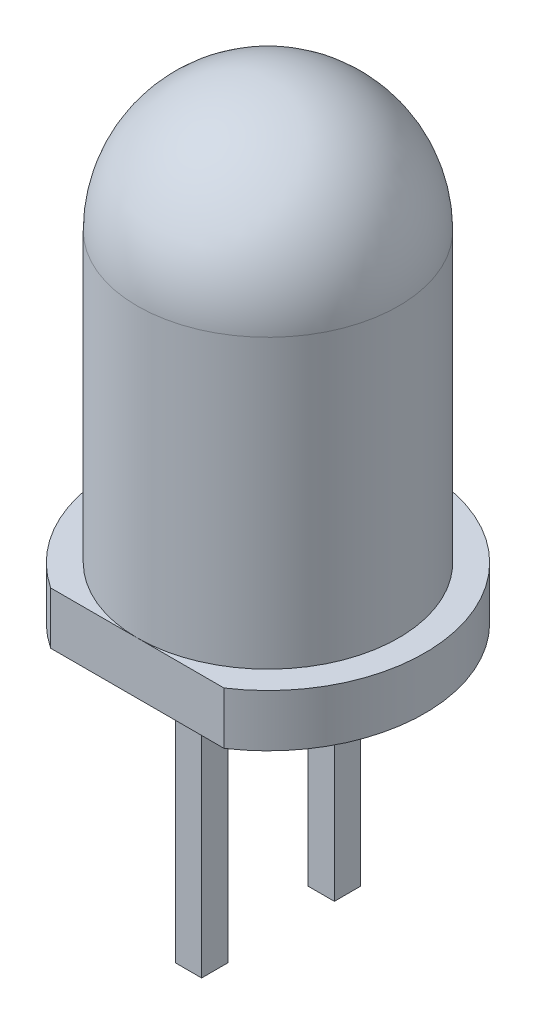
ISO-10303-21;
HEADER;
FILE_DESCRIPTION(('STEP AP214'),'2;1');
FILE_NAME('part.step','',(''),(''),'','','');
FILE_SCHEMA(('AUTOMOTIVE_DESIGN { 1 0 10303 214 1 1 1 1 }'));
ENDSEC;
DATA;
#1=APPLICATION_CONTEXT('core data for automotive mechanical design processes');
#2=APPLICATION_PROTOCOL_DEFINITION('international standard','automotive_design',2000,#1);
#3=PRODUCT_CONTEXT('',#1,'mechanical');
#4=PRODUCT('Part','Part','',(#3));
#5=PRODUCT_RELATED_PRODUCT_CATEGORY('part','',(#4));
#6=PRODUCT_DEFINITION_FORMATION('','',#4);
#7=PRODUCT_DEFINITION_CONTEXT('part definition',#1,'design');
#8=PRODUCT_DEFINITION('design','',#6,#7);
#9=PRODUCT_DEFINITION_SHAPE('','',#8);
#10=(LENGTH_UNIT() NAMED_UNIT(*) SI_UNIT(.MILLI.,.METRE.));
#11=(NAMED_UNIT(*) PLANE_ANGLE_UNIT() SI_UNIT($,.RADIAN.));
#12=(NAMED_UNIT(*) SI_UNIT($,.STERADIAN.) SOLID_ANGLE_UNIT());
#13=UNCERTAINTY_MEASURE_WITH_UNIT(LENGTH_MEASURE(1.E-05),#10,'distance_accuracy_value','');
#14=(GEOMETRIC_REPRESENTATION_CONTEXT(3) GLOBAL_UNCERTAINTY_ASSIGNED_CONTEXT((#13)) GLOBAL_UNIT_ASSIGNED_CONTEXT((#10,
#11,#12)) REPRESENTATION_CONTEXT('',''));
#15=CARTESIAN_POINT('',(0.,0.,0.));
#16=DIRECTION('',(0.,0.,1.));
#17=DIRECTION('',(1.,0.,0.));
#18=AXIS2_PLACEMENT_3D('',#15,#16,#17);
#19=CARTESIAN_POINT('',(0.,0.,0.));
#20=DIRECTION('',(0.,1.,0.));
#21=DIRECTION('',(1.,0.,0.));
#22=AXIS2_PLACEMENT_3D('',#19,#20,#21);
#23=CYLINDRICAL_SURFACE('',#22,2.5);
#24=CARTESIAN_POINT('',(0.,5.5,0.));
#25=DIRECTION('',(0.,1.,0.));
#26=DIRECTION('',(1.,0.,0.));
#27=AXIS2_PLACEMENT_3D('',#24,#25,#26);
#28=CIRCLE('',#27,2.5);
#29=CARTESIAN_POINT('',(-2.5,5.5,0.));
#30=VERTEX_POINT('',#29);
#31=CARTESIAN_POINT('',(0.,5.5,2.5));
#32=VERTEX_POINT('',#31);
#33=EDGE_CURVE('E178',#30,#32,#28,.T.);
#34=ORIENTED_EDGE('',*,*,#33,.F.);
#35=DIRECTION('',(0.,-1.,0.));
#36=VECTOR('',#35,1.);
#37=CARTESIAN_POINT('',(-2.5,0.,0.));
#38=LINE('',#37,#36);
#39=CARTESIAN_POINT('',(-2.5,0.,0.));
#40=VERTEX_POINT('',#39);
#41=EDGE_CURVE('E11',#30,#40,#38,.T.);
#42=ORIENTED_EDGE('',*,*,#41,.T.);
#43=CARTESIAN_POINT('',(0.,0.,0.));
#44=DIRECTION('',(0.,-1.,0.));
#45=DIRECTION('',(1.,0.,0.));
#46=AXIS2_PLACEMENT_3D('',#43,#44,#45);
#47=CIRCLE('',#46,2.5);
#48=CARTESIAN_POINT('',(0.,0.,2.5));
#49=VERTEX_POINT('',#48);
#50=EDGE_CURVE('E202',#49,#40,#47,.T.);
#51=ORIENTED_EDGE('',*,*,#50,.F.);
#52=CARTESIAN_POINT('',(0.,0.,0.));
#53=DIRECTION('',(0.,-1.,0.));
#54=DIRECTION('',(1.,0.,0.));
#55=AXIS2_PLACEMENT_3D('',#52,#53,#54);
#56=CIRCLE('',#55,2.5);
#57=EDGE_CURVE('E244',#40,#49,#56,.T.);
#58=ORIENTED_EDGE('',*,*,#57,.F.);
#59=ORIENTED_EDGE('',*,*,#41,.F.);
#60=CARTESIAN_POINT('',(0.,5.5,0.));
#61=DIRECTION('',(0.,1.,0.));
#62=DIRECTION('',(1.,0.,0.));
#63=AXIS2_PLACEMENT_3D('',#60,#61,#62);
#64=CIRCLE('',#63,2.5);
#65=EDGE_CURVE('E27',#32,#30,#64,.T.);
#66=ORIENTED_EDGE('',*,*,#65,.F.);
#67=EDGE_LOOP('',(#34,#42,#51,#58,#59,#66));
#68=FACE_BOUND('',#67,.T.);
#69=ADVANCED_FACE('F16',(#68),#23,.T.);
#70=CARTESIAN_POINT('',(0.,5.5,0.));
#71=DIRECTION('',(0.,1.,0.));
#72=DIRECTION('',(0.,0.,-1.));
#73=AXIS2_PLACEMENT_3D('',#70,#71,#72);
#74=SPHERICAL_SURFACE('',#73,2.5);
#75=ORIENTED_EDGE('',*,*,#33,.T.);
#76=CARTESIAN_POINT('',(0.,5.5,0.));
#77=DIRECTION('',(1.,0.,0.));
#78=DIRECTION('',(0.,0.,1.));
#79=AXIS2_PLACEMENT_3D('',#76,#77,#78);
#80=CIRCLE('',#79,2.5);
#81=CARTESIAN_POINT('',(0.,8.,0.));
#82=VERTEX_POINT('',#81);
#83=EDGE_CURVE('E40',#82,#32,#80,.T.);
#84=ORIENTED_EDGE('',*,*,#83,.F.);
#85=ORIENTED_EDGE('',*,*,#83,.T.);
#86=ORIENTED_EDGE('',*,*,#65,.T.);
#87=EDGE_LOOP('',(#75,#84,#85,#86));
#88=FACE_BOUND('',#87,.T.);
#89=ADVANCED_FACE('F300',(#88),#74,.T.);
#90=CARTESIAN_POINT('',(0.,-1.,0.0559551179846103));
#91=DIRECTION('',(0.,-1.,0.));
#92=DIRECTION('',(0.,0.,-1.));
#93=AXIS2_PLACEMENT_3D('',#90,#91,#92);
#94=PLANE('',#93);
#95=DIRECTION('',(0.,0.,1.));
#96=VECTOR('',#95,1.);
#97=CARTESIAN_POINT('',(-0.25,-1.,-0.482022441007695));
#98=LINE('',#97,#96);
#99=CARTESIAN_POINT('',(-0.25,-1.,-1.52));
#100=VERTEX_POINT('',#99);
#101=CARTESIAN_POINT('',(-0.25,-1.,-1.02));
#102=VERTEX_POINT('',#101);
#103=EDGE_CURVE('E174',#100,#102,#98,.T.);
#104=ORIENTED_EDGE('',*,*,#103,.T.);
#105=DIRECTION('',(1.,0.,0.));
#106=VECTOR('',#105,1.);
#107=CARTESIAN_POINT('',(0.125,-1.,-1.02));
#108=LINE('',#107,#106);
#109=CARTESIAN_POINT('',(0.25,-1.,-1.02));
#110=VERTEX_POINT('',#109);
#111=EDGE_CURVE('E133',#102,#110,#108,.T.);
#112=ORIENTED_EDGE('',*,*,#111,.T.);
#113=DIRECTION('',(0.,0.,-1.));
#114=VECTOR('',#113,1.);
#115=CARTESIAN_POINT('',(0.25,-1.,-0.732022441007695));
#116=LINE('',#115,#114);
#117=CARTESIAN_POINT('',(0.25,-1.,-1.52));
#118=VERTEX_POINT('',#117);
#119=EDGE_CURVE('E182',#110,#118,#116,.T.);
#120=ORIENTED_EDGE('',*,*,#119,.T.);
#121=DIRECTION('',(-1.,0.,0.));
#122=VECTOR('',#121,1.);
#123=CARTESIAN_POINT('',(-0.125,-1.,-1.52));
#124=LINE('',#123,#122);
#125=EDGE_CURVE('E198',#118,#100,#124,.T.);
#126=ORIENTED_EDGE('',*,*,#125,.T.);
#127=EDGE_LOOP('',(#104,#112,#120,#126));
#128=FACE_BOUND('',#127,.T.);
#129=DIRECTION('',(0.,0.,-1.));
#130=VECTOR('',#129,1.);
#131=CARTESIAN_POINT('',(0.25,-1.,0.537977558992305));
#132=LINE('',#131,#130);
#133=CARTESIAN_POINT('',(0.25,-1.,1.52));
#134=VERTEX_POINT('',#133);
#135=CARTESIAN_POINT('',(0.25,-1.,1.02));
#136=VERTEX_POINT('',#135);
#137=EDGE_CURVE('E186',#134,#136,#132,.T.);
#138=ORIENTED_EDGE('',*,*,#137,.T.);
#139=DIRECTION('',(-1.,0.,0.));
#140=VECTOR('',#139,1.);
#141=CARTESIAN_POINT('',(-0.125,-1.,1.02));
#142=LINE('',#141,#140);
#143=CARTESIAN_POINT('',(-0.25,-1.,1.02));
#144=VERTEX_POINT('',#143);
#145=EDGE_CURVE('E193',#136,#144,#142,.T.);
#146=ORIENTED_EDGE('',*,*,#145,.T.);
#147=DIRECTION('',(0.,0.,1.));
#148=VECTOR('',#147,1.);
#149=CARTESIAN_POINT('',(-0.25,-1.,0.787977558992305));
#150=LINE('',#149,#148);
#151=CARTESIAN_POINT('',(-0.25,-1.,1.52));
#152=VERTEX_POINT('',#151);
#153=EDGE_CURVE('E211',#144,#152,#150,.T.);
#154=ORIENTED_EDGE('',*,*,#153,.T.);
#155=DIRECTION('',(1.,0.,0.));
#156=VECTOR('',#155,1.);
#157=CARTESIAN_POINT('',(0.125,-1.,1.52));
#158=LINE('',#157,#156);
#159=EDGE_CURVE('E208',#152,#134,#158,.T.);
#160=ORIENTED_EDGE('',*,*,#159,.T.);
#161=EDGE_LOOP('',(#138,#146,#154,#160));
#162=FACE_BOUND('',#161,.T.);
#163=DIRECTION('',(-1.,0.,0.));
#164=VECTOR('',#163,1.);
#165=CARTESIAN_POINT('',(-1.6583123951777,-1.,2.5));
#166=LINE('',#165,#164);
#167=CARTESIAN_POINT('',(1.6583123951777,-1.,2.5));
#168=VERTEX_POINT('',#167);
#169=CARTESIAN_POINT('',(-1.6583123951777,-1.,2.5));
#170=VERTEX_POINT('',#169);
#171=EDGE_CURVE('E229',#168,#170,#166,.T.);
#172=ORIENTED_EDGE('',*,*,#171,.T.);
#173=CARTESIAN_POINT('',(0.,-1.,0.));
#174=DIRECTION('',(0.,-1.,0.));
#175=DIRECTION('',(0.552770798392567,0.,-0.833333333333333));
#176=AXIS2_PLACEMENT_3D('',#173,#174,#175);
#177=CIRCLE('',#176,3.);
#178=EDGE_CURVE('E260',#170,#168,#177,.T.);
#179=ORIENTED_EDGE('',*,*,#178,.T.);
#180=EDGE_LOOP('',(#172,#179));
#181=FACE_BOUND('',#180,.T.);
#182=ADVANCED_FACE('F281',(#128,#162,#181),#94,.T.);
#183=CARTESIAN_POINT('',(1.6583123951777,0.,2.5));
#184=DIRECTION('',(0.,0.,1.));
#185=DIRECTION('',(1.,0.,0.));
#186=AXIS2_PLACEMENT_3D('',#183,#184,#185);
#187=PLANE('',#186);
#188=DIRECTION('',(1.,0.,0.));
#189=VECTOR('',#188,1.);
#190=CARTESIAN_POINT('',(-1.6583123951777,0.,2.5));
#191=LINE('',#190,#189);
#192=CARTESIAN_POINT('',(-1.6583123951777,0.,2.5));
#193=VERTEX_POINT('',#192);
#194=EDGE_CURVE('E197',#193,#49,#191,.T.);
#195=ORIENTED_EDGE('',*,*,#194,.F.);
#196=DIRECTION('',(0.,-1.,0.));
#197=VECTOR('',#196,1.);
#198=CARTESIAN_POINT('',(-1.6583123951777,0.,2.5));
#199=LINE('',#198,#197);
#200=EDGE_CURVE('E233',#193,#170,#199,.T.);
#201=ORIENTED_EDGE('',*,*,#200,.T.);
#202=ORIENTED_EDGE('',*,*,#171,.F.);
#203=DIRECTION('',(0.,-1.,0.));
#204=VECTOR('',#203,1.);
#205=CARTESIAN_POINT('',(1.6583123951777,0.,2.5));
#206=LINE('',#205,#204);
#207=CARTESIAN_POINT('',(1.6583123951777,0.,2.5));
#208=VERTEX_POINT('',#207);
#209=EDGE_CURVE('E217',#208,#168,#206,.T.);
#210=ORIENTED_EDGE('',*,*,#209,.F.);
#211=DIRECTION('',(1.,0.,0.));
#212=VECTOR('',#211,1.);
#213=CARTESIAN_POINT('',(-1.6583123951777,0.,2.5));
#214=LINE('',#213,#212);
#215=EDGE_CURVE('E218',#49,#208,#214,.T.);
#216=ORIENTED_EDGE('',*,*,#215,.F.);
#217=EDGE_LOOP('',(#195,#201,#202,#210,#216));
#218=FACE_BOUND('',#217,.T.);
#219=ADVANCED_FACE('F316',(#218),#187,.T.);
#220=CARTESIAN_POINT('',(0.,0.,0.));
#221=DIRECTION('',(0.,-1.,0.));
#222=DIRECTION('',(0.552770798392567,0.,-0.833333333333333));
#223=AXIS2_PLACEMENT_3D('',#220,#221,#222);
#224=CYLINDRICAL_SURFACE('',#223,3.);
#225=CARTESIAN_POINT('',(0.,0.,0.));
#226=DIRECTION('',(0.,1.,0.));
#227=DIRECTION('',(0.552770798392567,0.,-0.833333333333333));
#228=AXIS2_PLACEMENT_3D('',#225,#226,#227);
#229=CIRCLE('',#228,3.);
#230=EDGE_CURVE('E213',#208,#193,#229,.T.);
#231=ORIENTED_EDGE('',*,*,#230,.F.);
#232=ORIENTED_EDGE('',*,*,#209,.T.);
#233=ORIENTED_EDGE('',*,*,#178,.F.);
#234=ORIENTED_EDGE('',*,*,#200,.F.);
#235=EDGE_LOOP('',(#231,#232,#233,#234));
#236=FACE_BOUND('',#235,.T.);
#237=ADVANCED_FACE('F314',(#236),#224,.T.);
#238=CARTESIAN_POINT('',(0.,0.,0.0559551179846103));
#239=DIRECTION('',(0.,-1.,0.));
#240=DIRECTION('',(0.,0.,-1.));
#241=AXIS2_PLACEMENT_3D('',#238,#239,#240);
#242=PLANE('',#241);
#243=ORIENTED_EDGE('',*,*,#194,.T.);
#244=ORIENTED_EDGE('',*,*,#50,.T.);
#245=ORIENTED_EDGE('',*,*,#57,.T.);
#246=ORIENTED_EDGE('',*,*,#215,.T.);
#247=ORIENTED_EDGE('',*,*,#230,.T.);
#248=EDGE_LOOP('',(#243,#244,#245,#246,#247));
#249=FACE_BOUND('',#248,.T.);
#250=ADVANCED_FACE('F295',(#249),#242,.F.);
#251=CARTESIAN_POINT('',(0.,-6.,-1.27));
#252=DIRECTION('',(0.,-1.,0.));
#253=DIRECTION('',(0.,0.,-1.));
#254=AXIS2_PLACEMENT_3D('',#251,#252,#253);
#255=PLANE('',#254);
#256=DIRECTION('',(1.,0.,0.));
#257=VECTOR('',#256,1.);
#258=CARTESIAN_POINT('',(-0.25,-6.,-1.52));
#259=LINE('',#258,#257);
#260=CARTESIAN_POINT('',(-0.25,-6.,-1.52));
#261=VERTEX_POINT('',#260);
#262=CARTESIAN_POINT('',(0.25,-6.,-1.52));
#263=VERTEX_POINT('',#262);
#264=EDGE_CURVE('E142',#261,#263,#259,.T.);
#265=ORIENTED_EDGE('',*,*,#264,.T.);
#266=DIRECTION('',(0.,0.,1.));
#267=VECTOR('',#266,1.);
#268=CARTESIAN_POINT('',(0.25,-6.,-1.52));
#269=LINE('',#268,#267);
#270=CARTESIAN_POINT('',(0.25,-6.,-1.02));
#271=VERTEX_POINT('',#270);
#272=EDGE_CURVE('E154',#263,#271,#269,.T.);
#273=ORIENTED_EDGE('',*,*,#272,.T.);
#274=DIRECTION('',(-1.,0.,0.));
#275=VECTOR('',#274,1.);
#276=CARTESIAN_POINT('',(0.25,-6.,-1.02));
#277=LINE('',#276,#275);
#278=CARTESIAN_POINT('',(-0.25,-6.,-1.02));
#279=VERTEX_POINT('',#278);
#280=EDGE_CURVE('E148',#271,#279,#277,.T.);
#281=ORIENTED_EDGE('',*,*,#280,.T.);
#282=DIRECTION('',(0.,0.,-1.));
#283=VECTOR('',#282,1.);
#284=CARTESIAN_POINT('',(-0.25,-6.,-1.02));
#285=LINE('',#284,#283);
#286=EDGE_CURVE('E151',#279,#261,#285,.T.);
#287=ORIENTED_EDGE('',*,*,#286,.T.);
#288=EDGE_LOOP('',(#265,#273,#281,#287));
#289=FACE_BOUND('',#288,.T.);
#290=ADVANCED_FACE('F149',(#289),#255,.T.);
#291=CARTESIAN_POINT('',(-0.25,-1.,-1.52));
#292=DIRECTION('',(0.,0.,-1.));
#293=DIRECTION('',(-1.,0.,0.));
#294=AXIS2_PLACEMENT_3D('',#291,#292,#293);
#295=PLANE('',#294);
#296=ORIENTED_EDGE('',*,*,#125,.F.);
#297=DIRECTION('',(0.,-1.,0.));
#298=VECTOR('',#297,1.);
#299=CARTESIAN_POINT('',(0.25,-1.,-1.52));
#300=LINE('',#299,#298);
#301=EDGE_CURVE('E252',#118,#263,#300,.T.);
#302=ORIENTED_EDGE('',*,*,#301,.T.);
#303=ORIENTED_EDGE('',*,*,#264,.F.);
#304=DIRECTION('',(0.,-1.,0.));
#305=VECTOR('',#304,1.);
#306=CARTESIAN_POINT('',(-0.25,-1.,-1.52));
#307=LINE('',#306,#305);
#308=EDGE_CURVE('E167',#100,#261,#307,.T.);
#309=ORIENTED_EDGE('',*,*,#308,.F.);
#310=EDGE_LOOP('',(#296,#302,#303,#309));
#311=FACE_BOUND('',#310,.T.);
#312=ADVANCED_FACE('F284',(#311),#295,.T.);
#313=CARTESIAN_POINT('',(0.25,-1.,-1.52));
#314=DIRECTION('',(1.,0.,0.));
#315=DIRECTION('',(0.,0.,-1.));
#316=AXIS2_PLACEMENT_3D('',#313,#314,#315);
#317=PLANE('',#316);
#318=ORIENTED_EDGE('',*,*,#119,.F.);
#319=DIRECTION('',(0.,-1.,0.));
#320=VECTOR('',#319,1.);
#321=CARTESIAN_POINT('',(0.25,-1.,-1.02));
#322=LINE('',#321,#320);
#323=EDGE_CURVE('E157',#110,#271,#322,.T.);
#324=ORIENTED_EDGE('',*,*,#323,.T.);
#325=ORIENTED_EDGE('',*,*,#272,.F.);
#326=ORIENTED_EDGE('',*,*,#301,.F.);
#327=EDGE_LOOP('',(#318,#324,#325,#326));
#328=FACE_BOUND('',#327,.T.);
#329=ADVANCED_FACE('F286',(#328),#317,.T.);
#330=CARTESIAN_POINT('',(0.25,-1.,-1.02));
#331=DIRECTION('',(0.,0.,1.));
#332=DIRECTION('',(1.,0.,0.));
#333=AXIS2_PLACEMENT_3D('',#330,#331,#332);
#334=PLANE('',#333);
#335=ORIENTED_EDGE('',*,*,#111,.F.);
#336=DIRECTION('',(0.,-1.,0.));
#337=VECTOR('',#336,1.);
#338=CARTESIAN_POINT('',(-0.25,-1.,-1.02));
#339=LINE('',#338,#337);
#340=EDGE_CURVE('E159',#102,#279,#339,.T.);
#341=ORIENTED_EDGE('',*,*,#340,.T.);
#342=ORIENTED_EDGE('',*,*,#280,.F.);
#343=ORIENTED_EDGE('',*,*,#323,.F.);
#344=EDGE_LOOP('',(#335,#341,#342,#343));
#345=FACE_BOUND('',#344,.T.);
#346=ADVANCED_FACE('F160',(#345),#334,.T.);
#347=CARTESIAN_POINT('',(-0.25,-1.,-1.02));
#348=DIRECTION('',(-1.,0.,0.));
#349=DIRECTION('',(0.,1.,0.));
#350=AXIS2_PLACEMENT_3D('',#347,#348,#349);
#351=PLANE('',#350);
#352=ORIENTED_EDGE('',*,*,#103,.F.);
#353=ORIENTED_EDGE('',*,*,#308,.T.);
#354=ORIENTED_EDGE('',*,*,#286,.F.);
#355=ORIENTED_EDGE('',*,*,#340,.F.);
#356=EDGE_LOOP('',(#352,#353,#354,#355));
#357=FACE_BOUND('',#356,.T.);
#358=ADVANCED_FACE('F166',(#357),#351,.T.);
#359=CARTESIAN_POINT('',(0.,-6.,1.27));
#360=DIRECTION('',(0.,-1.,0.));
#361=DIRECTION('',(0.,0.,-1.));
#362=AXIS2_PLACEMENT_3D('',#359,#360,#361);
#363=PLANE('',#362);
#364=DIRECTION('',(-1.,0.,0.));
#365=VECTOR('',#364,1.);
#366=CARTESIAN_POINT('',(-0.25,-6.,1.52));
#367=LINE('',#366,#365);
#368=CARTESIAN_POINT('',(0.25,-6.,1.52));
#369=VERTEX_POINT('',#368);
#370=CARTESIAN_POINT('',(-0.25,-6.,1.52));
#371=VERTEX_POINT('',#370);
#372=EDGE_CURVE('E90',#369,#371,#367,.T.);
#373=ORIENTED_EDGE('',*,*,#372,.T.);
#374=DIRECTION('',(0.,0.,-1.));
#375=VECTOR('',#374,1.);
#376=CARTESIAN_POINT('',(-0.25,-6.,1.02));
#377=LINE('',#376,#375);
#378=CARTESIAN_POINT('',(-0.25,-6.,1.02));
#379=VERTEX_POINT('',#378);
#380=EDGE_CURVE('E221',#371,#379,#377,.T.);
#381=ORIENTED_EDGE('',*,*,#380,.T.);
#382=DIRECTION('',(1.,0.,0.));
#383=VECTOR('',#382,1.);
#384=CARTESIAN_POINT('',(0.25,-6.,1.02));
#385=LINE('',#384,#383);
#386=CARTESIAN_POINT('',(0.25,-6.,1.02));
#387=VERTEX_POINT('',#386);
#388=EDGE_CURVE('E100',#379,#387,#385,.T.);
#389=ORIENTED_EDGE('',*,*,#388,.T.);
#390=DIRECTION('',(0.,0.,1.));
#391=VECTOR('',#390,1.);
#392=CARTESIAN_POINT('',(0.25,-6.,1.52));
#393=LINE('',#392,#391);
#394=EDGE_CURVE('E194',#387,#369,#393,.T.);
#395=ORIENTED_EDGE('',*,*,#394,.T.);
#396=EDGE_LOOP('',(#373,#381,#389,#395));
#397=FACE_BOUND('',#396,.T.);
#398=ADVANCED_FACE('F350',(#397),#363,.T.);
#399=CARTESIAN_POINT('',(0.25,-1.,1.52));
#400=DIRECTION('',(0.,0.,1.));
#401=DIRECTION('',(1.,0.,0.));
#402=AXIS2_PLACEMENT_3D('',#399,#400,#401);
#403=PLANE('',#402);
#404=ORIENTED_EDGE('',*,*,#159,.F.);
#405=DIRECTION('',(0.,-1.,0.));
#406=VECTOR('',#405,1.);
#407=CARTESIAN_POINT('',(-0.25,-1.,1.52));
#408=LINE('',#407,#406);
#409=EDGE_CURVE('E225',#152,#371,#408,.T.);
#410=ORIENTED_EDGE('',*,*,#409,.T.);
#411=ORIENTED_EDGE('',*,*,#372,.F.);
#412=DIRECTION('',(0.,-1.,0.));
#413=VECTOR('',#412,1.);
#414=CARTESIAN_POINT('',(0.25,-1.,1.52));
#415=LINE('',#414,#413);
#416=EDGE_CURVE('E20',#134,#369,#415,.T.);
#417=ORIENTED_EDGE('',*,*,#416,.F.);
#418=EDGE_LOOP('',(#404,#410,#411,#417));
#419=FACE_BOUND('',#418,.T.);
#420=ADVANCED_FACE('F340',(#419),#403,.T.);
#421=CARTESIAN_POINT('',(-0.25,-1.,1.52));
#422=DIRECTION('',(-1.,0.,0.));
#423=DIRECTION('',(0.,0.,1.));
#424=AXIS2_PLACEMENT_3D('',#421,#422,#423);
#425=PLANE('',#424);
#426=ORIENTED_EDGE('',*,*,#153,.F.);
#427=DIRECTION('',(0.,-1.,0.));
#428=VECTOR('',#427,1.);
#429=CARTESIAN_POINT('',(-0.25,-1.,1.02));
#430=LINE('',#429,#428);
#431=EDGE_CURVE('E205',#144,#379,#430,.T.);
#432=ORIENTED_EDGE('',*,*,#431,.T.);
#433=ORIENTED_EDGE('',*,*,#380,.F.);
#434=ORIENTED_EDGE('',*,*,#409,.F.);
#435=EDGE_LOOP('',(#426,#432,#433,#434));
#436=FACE_BOUND('',#435,.T.);
#437=ADVANCED_FACE('F18',(#436),#425,.T.);
#438=CARTESIAN_POINT('',(-0.25,-1.,1.02));
#439=DIRECTION('',(0.,0.,-1.));
#440=DIRECTION('',(0.,-1.,0.));
#441=AXIS2_PLACEMENT_3D('',#438,#439,#440);
#442=PLANE('',#441);
#443=ORIENTED_EDGE('',*,*,#145,.F.);
#444=DIRECTION('',(0.,-1.,0.));
#445=VECTOR('',#444,1.);
#446=CARTESIAN_POINT('',(0.25,-1.,1.02));
#447=LINE('',#446,#445);
#448=EDGE_CURVE('E190',#136,#387,#447,.T.);
#449=ORIENTED_EDGE('',*,*,#448,.T.);
#450=ORIENTED_EDGE('',*,*,#388,.F.);
#451=ORIENTED_EDGE('',*,*,#431,.F.);
#452=EDGE_LOOP('',(#443,#449,#450,#451));
#453=FACE_BOUND('',#452,.T.);
#454=ADVANCED_FACE('F310',(#453),#442,.T.);
#455=CARTESIAN_POINT('',(0.25,-1.,1.02));
#456=DIRECTION('',(1.,0.,0.));
#457=DIRECTION('',(0.,0.,1.));
#458=AXIS2_PLACEMENT_3D('',#455,#456,#457);
#459=PLANE('',#458);
#460=ORIENTED_EDGE('',*,*,#137,.F.);
#461=ORIENTED_EDGE('',*,*,#416,.T.);
#462=ORIENTED_EDGE('',*,*,#394,.F.);
#463=ORIENTED_EDGE('',*,*,#448,.F.);
#464=EDGE_LOOP('',(#460,#461,#462,#463));
#465=FACE_BOUND('',#464,.T.);
#466=ADVANCED_FACE('F311',(#465),#459,.T.);
#467=CLOSED_SHELL('',(#69,#89,#182,#219,#237,#250,#290,#312,#329,#346,#358,#398,#420,#437,#454,#466));
#468=MANIFOLD_SOLID_BREP('B1',#467);
#469=ADVANCED_BREP_SHAPE_REPRESENTATION('',(#18,#468),#14);
#470=SHAPE_DEFINITION_REPRESENTATION(#9,#469);
ENDSEC;
END-ISO-10303-21;
